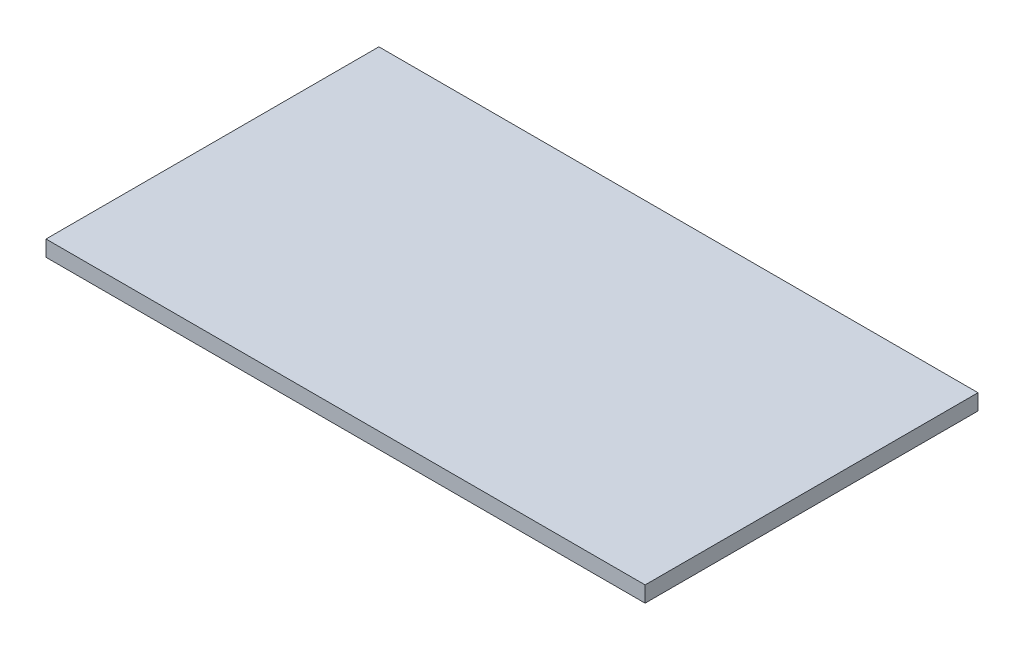
ISO-10303-21;
HEADER;
FILE_DESCRIPTION(('STEP AP214'),'2;1');
FILE_NAME('part.step','',(''),(''),'','','');
FILE_SCHEMA(('AUTOMOTIVE_DESIGN { 1 0 10303 214 1 1 1 1 }'));
ENDSEC;
DATA;
#1=APPLICATION_CONTEXT('core data for automotive mechanical design processes');
#2=APPLICATION_PROTOCOL_DEFINITION('international standard','automotive_design',2000,#1);
#3=PRODUCT_CONTEXT('',#1,'mechanical');
#4=PRODUCT('Part','Part','',(#3));
#5=PRODUCT_RELATED_PRODUCT_CATEGORY('part','',(#4));
#6=PRODUCT_DEFINITION_FORMATION('','',#4);
#7=PRODUCT_DEFINITION_CONTEXT('part definition',#1,'design');
#8=PRODUCT_DEFINITION('design','',#6,#7);
#9=PRODUCT_DEFINITION_SHAPE('','',#8);
#10=(LENGTH_UNIT() NAMED_UNIT(*) SI_UNIT(.MILLI.,.METRE.));
#11=(NAMED_UNIT(*) PLANE_ANGLE_UNIT() SI_UNIT($,.RADIAN.));
#12=(NAMED_UNIT(*) SI_UNIT($,.STERADIAN.) SOLID_ANGLE_UNIT());
#13=UNCERTAINTY_MEASURE_WITH_UNIT(LENGTH_MEASURE(1.E-05),#10,'distance_accuracy_value','');
#14=(GEOMETRIC_REPRESENTATION_CONTEXT(3) GLOBAL_UNCERTAINTY_ASSIGNED_CONTEXT((#13)) GLOBAL_UNIT_ASSIGNED_CONTEXT((#10,
#11,#12)) REPRESENTATION_CONTEXT('',''));
#15=CARTESIAN_POINT('',(0.,0.,0.));
#16=DIRECTION('',(0.,0.,1.));
#17=DIRECTION('',(1.,0.,0.));
#18=AXIS2_PLACEMENT_3D('',#15,#16,#17);
#19=CARTESIAN_POINT('',(-28.7027298850575,3.175,-18.1650143678161));
#20=DIRECTION('',(1.,0.,0.));
#21=DIRECTION('',(0.,0.,-1.));
#22=AXIS2_PLACEMENT_3D('',#19,#20,#21);
#23=PLANE('',#22);
#24=DIRECTION('',(0.,0.,1.));
#25=VECTOR('',#24,1.);
#26=CARTESIAN_POINT('',(-28.7027298850575,0.,-18.1650143678161));
#27=LINE('',#26,#25);
#28=CARTESIAN_POINT('',(-28.7027298850575,0.,-18.1650143678161));
#29=VERTEX_POINT('',#28);
#30=CARTESIAN_POINT('',(-28.7027298850575,0.,48.5099856321839));
#31=VERTEX_POINT('',#30);
#32=EDGE_CURVE('E96',#29,#31,#27,.T.);
#33=ORIENTED_EDGE('',*,*,#32,.T.);
#34=DIRECTION('',(0.,-1.,0.));
#35=VECTOR('',#34,1.);
#36=CARTESIAN_POINT('',(-28.7027298850575,3.175,48.5099856321839));
#37=LINE('',#36,#35);
#38=CARTESIAN_POINT('',(-28.7027298850575,3.175,48.5099856321839));
#39=VERTEX_POINT('',#38);
#40=EDGE_CURVE('E11',#39,#31,#37,.T.);
#41=ORIENTED_EDGE('',*,*,#40,.F.);
#42=DIRECTION('',(0.,0.,1.));
#43=VECTOR('',#42,1.);
#44=CARTESIAN_POINT('',(-28.7027298850575,3.175,-18.1650143678161));
#45=LINE('',#44,#43);
#46=CARTESIAN_POINT('',(-28.7027298850575,3.175,-18.1650143678161));
#47=VERTEX_POINT('',#46);
#48=EDGE_CURVE('E84',#47,#39,#45,.T.);
#49=ORIENTED_EDGE('',*,*,#48,.F.);
#50=DIRECTION('',(0.,-1.,0.));
#51=VECTOR('',#50,1.);
#52=CARTESIAN_POINT('',(-28.7027298850575,3.175,-18.1650143678161));
#53=LINE('',#52,#51);
#54=EDGE_CURVE('E92',#47,#29,#53,.T.);
#55=ORIENTED_EDGE('',*,*,#54,.T.);
#56=EDGE_LOOP('',(#33,#41,#49,#55));
#57=FACE_BOUND('',#56,.T.);
#58=ADVANCED_FACE('F33',(#57),#23,.F.);
#59=CARTESIAN_POINT('',(-28.7027298850575,3.175,48.5099856321839));
#60=DIRECTION('',(0.,0.,-1.));
#61=DIRECTION('',(-1.,0.,0.));
#62=AXIS2_PLACEMENT_3D('',#59,#60,#61);
#63=PLANE('',#62);
#64=DIRECTION('',(1.,0.,0.));
#65=VECTOR('',#64,1.);
#66=CARTESIAN_POINT('',(-28.7027298850575,0.,48.5099856321839));
#67=LINE('',#66,#65);
#68=CARTESIAN_POINT('',(91.2972701149425,0.,48.5099856321839));
#69=VERTEX_POINT('',#68);
#70=EDGE_CURVE('E88',#31,#69,#67,.T.);
#71=ORIENTED_EDGE('',*,*,#70,.T.);
#72=DIRECTION('',(0.,-1.,0.));
#73=VECTOR('',#72,1.);
#74=CARTESIAN_POINT('',(91.2972701149425,3.175,48.5099856321839));
#75=LINE('',#74,#73);
#76=CARTESIAN_POINT('',(91.2972701149425,3.175,48.5099856321839));
#77=VERTEX_POINT('',#76);
#78=EDGE_CURVE('E41',#77,#69,#75,.T.);
#79=ORIENTED_EDGE('',*,*,#78,.F.);
#80=DIRECTION('',(1.,0.,0.));
#81=VECTOR('',#80,1.);
#82=CARTESIAN_POINT('',(-28.7027298850575,3.175,48.5099856321839));
#83=LINE('',#82,#81);
#84=EDGE_CURVE('E79',#39,#77,#83,.T.);
#85=ORIENTED_EDGE('',*,*,#84,.F.);
#86=ORIENTED_EDGE('',*,*,#40,.T.);
#87=EDGE_LOOP('',(#71,#79,#85,#86));
#88=FACE_BOUND('',#87,.T.);
#89=ADVANCED_FACE('F87',(#88),#63,.F.);
#90=CARTESIAN_POINT('',(91.2972701149425,3.175,-18.1650143678161));
#91=DIRECTION('',(-1.,0.,0.));
#92=DIRECTION('',(0.,0.,1.));
#93=AXIS2_PLACEMENT_3D('',#90,#91,#92);
#94=PLANE('',#93);
#95=DIRECTION('',(0.,0.,-1.));
#96=VECTOR('',#95,1.);
#97=CARTESIAN_POINT('',(91.2972701149425,0.,-18.1650143678161));
#98=LINE('',#97,#96);
#99=CARTESIAN_POINT('',(91.2972701149425,0.,-18.1650143678161));
#100=VERTEX_POINT('',#99);
#101=EDGE_CURVE('E66',#69,#100,#98,.T.);
#102=ORIENTED_EDGE('',*,*,#101,.T.);
#103=DIRECTION('',(0.,-1.,0.));
#104=VECTOR('',#103,1.);
#105=CARTESIAN_POINT('',(91.2972701149425,3.175,-18.1650143678161));
#106=LINE('',#105,#104);
#107=CARTESIAN_POINT('',(91.2972701149425,3.175,-18.1650143678161));
#108=VERTEX_POINT('',#107);
#109=EDGE_CURVE('E89',#108,#100,#106,.T.);
#110=ORIENTED_EDGE('',*,*,#109,.F.);
#111=DIRECTION('',(0.,0.,-1.));
#112=VECTOR('',#111,1.);
#113=CARTESIAN_POINT('',(91.2972701149425,3.175,-18.1650143678161));
#114=LINE('',#113,#112);
#115=EDGE_CURVE('E82',#77,#108,#114,.T.);
#116=ORIENTED_EDGE('',*,*,#115,.F.);
#117=ORIENTED_EDGE('',*,*,#78,.T.);
#118=EDGE_LOOP('',(#102,#110,#116,#117));
#119=FACE_BOUND('',#118,.T.);
#120=ADVANCED_FACE('F90',(#119),#94,.F.);
#121=CARTESIAN_POINT('',(-28.7027298850575,3.175,-18.1650143678161));
#122=DIRECTION('',(0.,0.,1.));
#123=DIRECTION('',(1.,0.,0.));
#124=AXIS2_PLACEMENT_3D('',#121,#122,#123);
#125=PLANE('',#124);
#126=DIRECTION('',(-1.,0.,0.));
#127=VECTOR('',#126,1.);
#128=CARTESIAN_POINT('',(-28.7027298850575,0.,-18.1650143678161));
#129=LINE('',#128,#127);
#130=EDGE_CURVE('E72',#100,#29,#129,.T.);
#131=ORIENTED_EDGE('',*,*,#130,.T.);
#132=ORIENTED_EDGE('',*,*,#54,.F.);
#133=DIRECTION('',(-1.,0.,0.));
#134=VECTOR('',#133,1.);
#135=CARTESIAN_POINT('',(-28.7027298850575,3.175,-18.1650143678161));
#136=LINE('',#135,#134);
#137=EDGE_CURVE('E49',#108,#47,#136,.T.);
#138=ORIENTED_EDGE('',*,*,#137,.F.);
#139=ORIENTED_EDGE('',*,*,#109,.T.);
#140=EDGE_LOOP('',(#131,#132,#138,#139));
#141=FACE_BOUND('',#140,.T.);
#142=ADVANCED_FACE('F103',(#141),#125,.F.);
#143=CARTESIAN_POINT('',(0.,3.175,0.));
#144=DIRECTION('',(0.,1.,0.));
#145=DIRECTION('',(0.,0.,1.));
#146=AXIS2_PLACEMENT_3D('',#143,#144,#145);
#147=PLANE('',#146);
#148=ORIENTED_EDGE('',*,*,#48,.T.);
#149=ORIENTED_EDGE('',*,*,#84,.T.);
#150=ORIENTED_EDGE('',*,*,#115,.T.);
#151=ORIENTED_EDGE('',*,*,#137,.T.);
#152=EDGE_LOOP('',(#148,#149,#150,#151));
#153=FACE_BOUND('',#152,.T.);
#154=ADVANCED_FACE('F80',(#153),#147,.T.);
#155=CARTESIAN_POINT('',(0.,0.,0.));
#156=DIRECTION('',(0.,1.,0.));
#157=DIRECTION('',(0.,0.,1.));
#158=AXIS2_PLACEMENT_3D('',#155,#156,#157);
#159=PLANE('',#158);
#160=ORIENTED_EDGE('',*,*,#32,.F.);
#161=ORIENTED_EDGE('',*,*,#130,.F.);
#162=ORIENTED_EDGE('',*,*,#101,.F.);
#163=ORIENTED_EDGE('',*,*,#70,.F.);
#164=EDGE_LOOP('',(#160,#161,#162,#163));
#165=FACE_BOUND('',#164,.T.);
#166=ADVANCED_FACE('F106',(#165),#159,.F.);
#167=CLOSED_SHELL('',(#58,#89,#120,#142,#154,#166));
#168=MANIFOLD_SOLID_BREP('B2',#167);
#169=ADVANCED_BREP_SHAPE_REPRESENTATION('',(#18,#168),#14);
#170=SHAPE_DEFINITION_REPRESENTATION(#9,#169);
ENDSEC;
END-ISO-10303-21;
